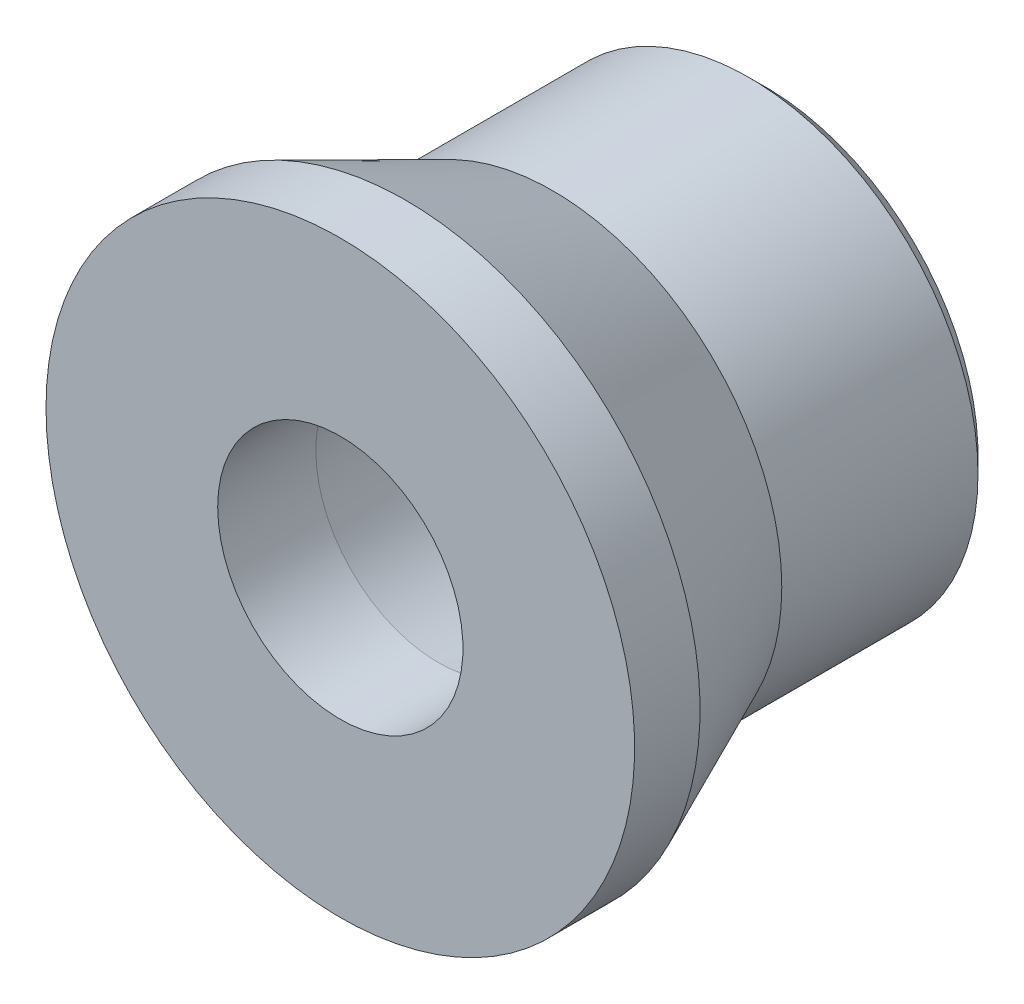
ISO-10303-21;
HEADER;
FILE_DESCRIPTION(('STEP AP214'),'2;1');
FILE_NAME('part.step','',(''),(''),'','','');
FILE_SCHEMA(('AUTOMOTIVE_DESIGN { 1 0 10303 214 1 1 1 1 }'));
ENDSEC;
DATA;
#1=APPLICATION_CONTEXT('core data for automotive mechanical design processes');
#2=APPLICATION_PROTOCOL_DEFINITION('international standard','automotive_design',2000,#1);
#3=PRODUCT_CONTEXT('',#1,'mechanical');
#4=PRODUCT('Part','Part','',(#3));
#5=PRODUCT_RELATED_PRODUCT_CATEGORY('part','',(#4));
#6=PRODUCT_DEFINITION_FORMATION('','',#4);
#7=PRODUCT_DEFINITION_CONTEXT('part definition',#1,'design');
#8=PRODUCT_DEFINITION('design','',#6,#7);
#9=PRODUCT_DEFINITION_SHAPE('','',#8);
#10=(LENGTH_UNIT() NAMED_UNIT(*) SI_UNIT(.MILLI.,.METRE.));
#11=(NAMED_UNIT(*) PLANE_ANGLE_UNIT() SI_UNIT($,.RADIAN.));
#12=(NAMED_UNIT(*) SI_UNIT($,.STERADIAN.) SOLID_ANGLE_UNIT());
#13=UNCERTAINTY_MEASURE_WITH_UNIT(LENGTH_MEASURE(1.E-05),#10,'distance_accuracy_value','');
#14=(GEOMETRIC_REPRESENTATION_CONTEXT(3) GLOBAL_UNCERTAINTY_ASSIGNED_CONTEXT((#13)) GLOBAL_UNIT_ASSIGNED_CONTEXT((#10,
#11,#12)) REPRESENTATION_CONTEXT('',''));
#15=CARTESIAN_POINT('',(0.,0.,0.));
#16=DIRECTION('',(0.,0.,1.));
#17=DIRECTION('',(1.,0.,0.));
#18=AXIS2_PLACEMENT_3D('',#15,#16,#17);
#19=CARTESIAN_POINT('',(0.,0.,13.));
#20=DIRECTION('',(0.,0.,-1.));
#21=DIRECTION('',(-1.,0.,0.));
#22=AXIS2_PLACEMENT_3D('',#19,#20,#21);
#23=CYLINDRICAL_SURFACE('',#22,7.0000000002608);
#24=CARTESIAN_POINT('',(0.,0.,6.49999999974421));
#25=DIRECTION('',(0.,0.,-1.));
#26=DIRECTION('',(-1.,0.,0.));
#27=AXIS2_PLACEMENT_3D('',#24,#25,#26);
#28=CIRCLE('',#27,7.0000000002608);
#29=CARTESIAN_POINT('',(-7.0000000002608,0.,6.49999999974421));
#30=VERTEX_POINT('',#29);
#31=EDGE_CURVE('E10',#30,#30,#28,.T.);
#32=ORIENTED_EDGE('',*,*,#31,.T.);
#33=EDGE_LOOP('',(#32));
#34=FACE_BOUND('',#33,.T.);
#35=CARTESIAN_POINT('',(0.,0.,0.500000000073442));
#36=DIRECTION('',(0.,0.,-1.));
#37=DIRECTION('',(-1.,0.,0.));
#38=AXIS2_PLACEMENT_3D('',#35,#36,#37);
#39=CIRCLE('',#38,7.0000000002608);
#40=CARTESIAN_POINT('',(-7.0000000002608,0.,0.500000000073442));
#41=VERTEX_POINT('',#40);
#42=EDGE_CURVE('E58',#41,#41,#39,.T.);
#43=ORIENTED_EDGE('',*,*,#42,.F.);
#44=EDGE_LOOP('',(#43));
#45=FACE_BOUND('',#44,.T.);
#46=ADVANCED_FACE('F30',(#34,#45),#23,.T.);
#47=CARTESIAN_POINT('',(0.,0.,6.49999999974421));
#48=DIRECTION('',(0.,0.,1.));
#49=DIRECTION('',(1.,0.,0.));
#50=AXIS2_PLACEMENT_3D('',#47,#48,#49);
#51=CONICAL_SURFACE('',#50,7.0000000002608,0.418224329579229);
#52=CARTESIAN_POINT('',(0.,0.,10.9999999997442));
#53=DIRECTION('',(0.,0.,-1.));
#54=DIRECTION('',(-1.,0.,0.));
#55=AXIS2_PLACEMENT_3D('',#52,#53,#54);
#56=CIRCLE('',#55,9.0000000002608);
#57=CARTESIAN_POINT('',(-9.0000000002608,0.,10.9999999997442));
#58=VERTEX_POINT('',#57);
#59=EDGE_CURVE('E36',#58,#58,#56,.T.);
#60=ORIENTED_EDGE('',*,*,#59,.T.);
#61=EDGE_LOOP('',(#60));
#62=FACE_BOUND('',#61,.T.);
#63=ORIENTED_EDGE('',*,*,#31,.F.);
#64=EDGE_LOOP('',(#63));
#65=FACE_BOUND('',#64,.T.);
#66=ADVANCED_FACE('F66',(#62,#65),#51,.T.);
#67=CARTESIAN_POINT('',(0.,0.,13.));
#68=DIRECTION('',(0.,0.,-1.));
#69=DIRECTION('',(-1.,0.,0.));
#70=AXIS2_PLACEMENT_3D('',#67,#68,#69);
#71=CYLINDRICAL_SURFACE('',#70,9.0000000002608);
#72=CARTESIAN_POINT('',(0.,0.,13.));
#73=DIRECTION('',(0.,0.,-1.));
#74=DIRECTION('',(-1.,0.,0.));
#75=AXIS2_PLACEMENT_3D('',#72,#73,#74);
#76=CIRCLE('',#75,9.0000000002608);
#77=CARTESIAN_POINT('',(-9.0000000002608,0.,13.));
#78=VERTEX_POINT('',#77);
#79=EDGE_CURVE('E40',#78,#78,#76,.T.);
#80=ORIENTED_EDGE('',*,*,#79,.T.);
#81=EDGE_LOOP('',(#80));
#82=FACE_BOUND('',#81,.T.);
#83=ORIENTED_EDGE('',*,*,#59,.F.);
#84=EDGE_LOOP('',(#83));
#85=FACE_BOUND('',#84,.T.);
#86=ADVANCED_FACE('F70',(#82,#85),#71,.T.);
#87=CARTESIAN_POINT('',(9.0000000002608,0.,13.));
#88=DIRECTION('',(0.,0.,1.));
#89=DIRECTION('',(1.,0.,0.));
#90=AXIS2_PLACEMENT_3D('',#87,#88,#89);
#91=PLANE('',#90);
#92=CARTESIAN_POINT('',(0.,0.,13.));
#93=DIRECTION('',(0.,0.,-1.));
#94=DIRECTION('',(-1.,0.,0.));
#95=AXIS2_PLACEMENT_3D('',#92,#93,#94);
#96=CIRCLE('',#95,3.75000000070713);
#97=CARTESIAN_POINT('',(-3.75000000070713,0.,13.));
#98=VERTEX_POINT('',#97);
#99=EDGE_CURVE('E44',#98,#98,#96,.T.);
#100=ORIENTED_EDGE('',*,*,#99,.T.);
#101=EDGE_LOOP('',(#100));
#102=FACE_BOUND('',#101,.T.);
#103=ORIENTED_EDGE('',*,*,#79,.F.);
#104=EDGE_LOOP('',(#103));
#105=FACE_BOUND('',#104,.T.);
#106=ADVANCED_FACE('F74',(#102,#105),#91,.T.);
#107=CARTESIAN_POINT('',(0.,0.,13.));
#108=DIRECTION('',(0.,0.,-1.));
#109=DIRECTION('',(-1.,0.,0.));
#110=AXIS2_PLACEMENT_3D('',#107,#108,#109);
#111=CYLINDRICAL_SURFACE('',#110,3.75000000070713);
#112=CARTESIAN_POINT('',(0.,0.,10.0000000001046));
#113=DIRECTION('',(0.,0.,-1.));
#114=DIRECTION('',(-1.,0.,0.));
#115=AXIS2_PLACEMENT_3D('',#112,#113,#114);
#116=CIRCLE('',#115,3.75000000070713);
#117=CARTESIAN_POINT('',(-3.75000000070713,0.,10.0000000001046));
#118=VERTEX_POINT('',#117);
#119=EDGE_CURVE('E49',#118,#118,#116,.T.);
#120=ORIENTED_EDGE('',*,*,#119,.T.);
#121=EDGE_LOOP('',(#120));
#122=FACE_BOUND('',#121,.T.);
#123=ORIENTED_EDGE('',*,*,#99,.F.);
#124=EDGE_LOOP('',(#123));
#125=FACE_BOUND('',#124,.T.);
#126=ADVANCED_FACE('F81',(#122,#125),#111,.F.);
#127=CARTESIAN_POINT('',(0.,0.,10.0000000001046));
#128=DIRECTION('',(0.,0.,-1.));
#129=DIRECTION('',(-1.,0.,0.));
#130=AXIS2_PLACEMENT_3D('',#127,#128,#129);
#131=CONICAL_SURFACE('',#130,3.75000000070713,0.12435499440474);
#132=CARTESIAN_POINT('',(0.,0.,-5.6843418860808E-11));
#133=DIRECTION('',(0.,0.,-1.));
#134=DIRECTION('',(-1.,0.,0.));
#135=AXIS2_PLACEMENT_3D('',#132,#133,#134);
#136=CIRCLE('',#135,4.99999999928491);
#137=CARTESIAN_POINT('',(-4.99999999928491,0.,-5.6843418860808E-11));
#138=VERTEX_POINT('',#137);
#139=EDGE_CURVE('E52',#138,#138,#136,.T.);
#140=ORIENTED_EDGE('',*,*,#139,.T.);
#141=EDGE_LOOP('',(#140));
#142=FACE_BOUND('',#141,.T.);
#143=ORIENTED_EDGE('',*,*,#119,.F.);
#144=EDGE_LOOP('',(#143));
#145=FACE_BOUND('',#144,.T.);
#146=ADVANCED_FACE('F85',(#142,#145),#131,.F.);
#147=CARTESIAN_POINT('',(4.99999999928491,0.,-5.6843418860808E-11));
#148=DIRECTION('',(0.,0.,-1.));
#149=DIRECTION('',(-1.,0.,0.));
#150=AXIS2_PLACEMENT_3D('',#147,#148,#149);
#151=PLANE('',#150);
#152=CARTESIAN_POINT('',(0.,0.,-5.6843418860808E-11));
#153=DIRECTION('',(0.,0.,-1.));
#154=DIRECTION('',(-1.,0.,0.));
#155=AXIS2_PLACEMENT_3D('',#152,#153,#154);
#156=CIRCLE('',#155,6.50000000013051);
#157=CARTESIAN_POINT('',(-6.50000000013051,0.,-5.6843418860808E-11));
#158=VERTEX_POINT('',#157);
#159=EDGE_CURVE('E55',#158,#158,#156,.T.);
#160=ORIENTED_EDGE('',*,*,#159,.T.);
#161=EDGE_LOOP('',(#160));
#162=FACE_BOUND('',#161,.T.);
#163=ORIENTED_EDGE('',*,*,#139,.F.);
#164=EDGE_LOOP('',(#163));
#165=FACE_BOUND('',#164,.T.);
#166=ADVANCED_FACE('F89',(#162,#165),#151,.T.);
#167=CARTESIAN_POINT('',(0.,0.,-5.6843418860808E-11));
#168=DIRECTION('',(0.,0.,1.));
#169=DIRECTION('',(1.,0.,0.));
#170=AXIS2_PLACEMENT_3D('',#167,#168,#169);
#171=CONICAL_SURFACE('',#170,6.50000000013051,0.785398163397449);
#172=ORIENTED_EDGE('',*,*,#42,.T.);
#173=EDGE_LOOP('',(#172));
#174=FACE_BOUND('',#173,.T.);
#175=ORIENTED_EDGE('',*,*,#159,.F.);
#176=EDGE_LOOP('',(#175));
#177=FACE_BOUND('',#176,.T.);
#178=ADVANCED_FACE('F62',(#174,#177),#171,.T.);
#179=CLOSED_SHELL('',(#46,#66,#86,#106,#126,#146,#166,#178));
#180=MANIFOLD_SOLID_BREP('B2',#179);
#181=ADVANCED_BREP_SHAPE_REPRESENTATION('',(#18,#180),#14);
#182=SHAPE_DEFINITION_REPRESENTATION(#9,#181);
ENDSEC;
END-ISO-10303-21;
